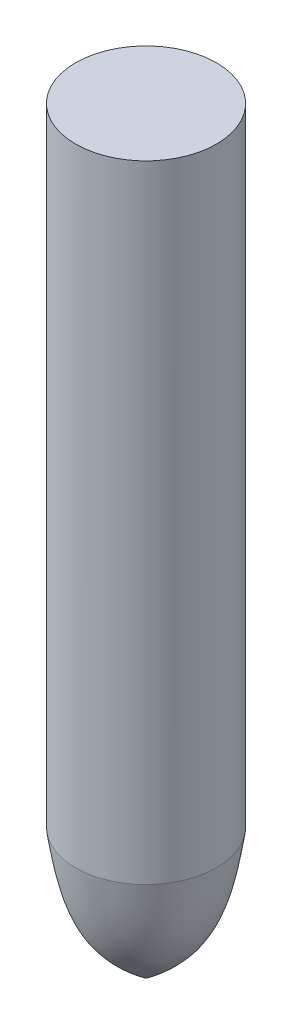
ISO-10303-21;
HEADER;
FILE_DESCRIPTION(('STEP AP214'),'2;1');
FILE_NAME('part.step','',(''),(''),'','','');
FILE_SCHEMA(('AUTOMOTIVE_DESIGN { 1 0 10303 214 1 1 1 1 }'));
ENDSEC;
DATA;
#1=APPLICATION_CONTEXT('core data for automotive mechanical design processes');
#2=APPLICATION_PROTOCOL_DEFINITION('international standard','automotive_design',2000,#1);
#3=PRODUCT_CONTEXT('',#1,'mechanical');
#4=PRODUCT('Part','Part','',(#3));
#5=PRODUCT_RELATED_PRODUCT_CATEGORY('part','',(#4));
#6=PRODUCT_DEFINITION_FORMATION('','',#4);
#7=PRODUCT_DEFINITION_CONTEXT('part definition',#1,'design');
#8=PRODUCT_DEFINITION('design','',#6,#7);
#9=PRODUCT_DEFINITION_SHAPE('','',#8);
#10=(LENGTH_UNIT() NAMED_UNIT(*) SI_UNIT(.MILLI.,.METRE.));
#11=(NAMED_UNIT(*) PLANE_ANGLE_UNIT() SI_UNIT($,.RADIAN.));
#12=(NAMED_UNIT(*) SI_UNIT($,.STERADIAN.) SOLID_ANGLE_UNIT());
#13=UNCERTAINTY_MEASURE_WITH_UNIT(LENGTH_MEASURE(1.E-05),#10,'distance_accuracy_value','');
#14=(GEOMETRIC_REPRESENTATION_CONTEXT(3) GLOBAL_UNCERTAINTY_ASSIGNED_CONTEXT((#13)) GLOBAL_UNIT_ASSIGNED_CONTEXT((#10,
#11,#12)) REPRESENTATION_CONTEXT('',''));
#15=CARTESIAN_POINT('',(0.,0.,0.));
#16=DIRECTION('',(0.,0.,1.));
#17=DIRECTION('',(1.,0.,0.));
#18=AXIS2_PLACEMENT_3D('',#15,#16,#17);
#19=CARTESIAN_POINT('',(0.,375.,0.));
#20=DIRECTION('',(0.,-1.,0.));
#21=DIRECTION('',(0.,0.,-1.));
#22=AXIS2_PLACEMENT_3D('',#19,#20,#21);
#23=CYLINDRICAL_SURFACE('',#22,70.);
#24=CARTESIAN_POINT('',(0.,375.,0.));
#25=DIRECTION('',(0.,1.,0.));
#26=DIRECTION('',(0.,0.,1.));
#27=AXIS2_PLACEMENT_3D('',#24,#25,#26);
#28=CIRCLE('',#27,70.);
#29=CARTESIAN_POINT('',(0.,375.,70.));
#30=VERTEX_POINT('',#29);
#31=EDGE_CURVE('E10',#30,#30,#28,.T.);
#32=ORIENTED_EDGE('',*,*,#31,.F.);
#33=EDGE_LOOP('',(#32));
#34=FACE_BOUND('',#33,.T.);
#35=CARTESIAN_POINT('',(0.,-247.794305725926,0.));
#36=DIRECTION('',(0.,-1.,0.));
#37=DIRECTION('',(0.,0.,-1.));
#38=AXIS2_PLACEMENT_3D('',#35,#36,#37);
#39=CIRCLE('',#38,70.);
#40=CARTESIAN_POINT('',(0.,-247.794305725926,-70.));
#41=VERTEX_POINT('',#40);
#42=EDGE_CURVE('E38',#41,#41,#39,.T.);
#43=ORIENTED_EDGE('',*,*,#42,.F.);
#44=EDGE_LOOP('',(#43));
#45=FACE_BOUND('',#44,.T.);
#46=ADVANCED_FACE('F28',(#34,#45),#23,.T.);
#47=CARTESIAN_POINT('',(0.,375.,0.));
#48=DIRECTION('',(0.,1.,0.));
#49=DIRECTION('',(0.,0.,1.));
#50=AXIS2_PLACEMENT_3D('',#47,#48,#49);
#51=PLANE('',#50);
#52=ORIENTED_EDGE('',*,*,#31,.T.);
#53=EDGE_LOOP('',(#52));
#54=FACE_BOUND('',#53,.T.);
#55=ADVANCED_FACE('F53',(#54),#51,.T.);
#56=CARTESIAN_POINT('',(0.,-377.97119896181,0.));
#57=CARTESIAN_POINT('',(-15.769115631653,-365.472402654188,0.));
#58=CARTESIAN_POINT('',(-56.7536963330036,-332.987516506786,0.));
#59=CARTESIAN_POINT('',(-64.9545094187256,-280.244229371744,0.));
#60=CARTESIAN_POINT('',(-70.,-247.794305725926,0.));
#61=B_SPLINE_CURVE_WITH_KNOTS('',3,(#56,#57,#58,#59,#60),.UNSPECIFIED.,.F.,.F.,(4,1,4),(0.,
0.384757276073179,1.),.UNSPECIFIED.);
#62=CARTESIAN_POINT('',(0.,-315.550160193087,0.));
#63=DIRECTION('',(0.,-1.,0.));
#64=AXIS1_PLACEMENT('',#62,#63);
#65=SURFACE_OF_REVOLUTION('',#61,#64);
#66=ORIENTED_EDGE('',*,*,#42,.T.);
#67=EDGE_LOOP('',(#66));
#68=FACE_BOUND('',#67,.T.);
#69=CARTESIAN_POINT('',(0.,-375.,0.));
#70=DIRECTION('',(0.,-1.,0.));
#71=DIRECTION('',(0.,0.,-1.));
#72=AXIS2_PLACEMENT_3D('',#69,#70,#71);
#73=CIRCLE('',#72,3.74432461317094);
#74=CARTESIAN_POINT('',(0.,-375.,-3.74432461317094));
#75=VERTEX_POINT('',#74);
#76=EDGE_CURVE('E31',#75,#75,#73,.F.);
#77=ORIENTED_EDGE('',*,*,#76,.T.);
#78=EDGE_LOOP('',(#77));
#79=FACE_BOUND('',#78,.T.);
#80=ADVANCED_FACE('F49',(#68,#79),#65,.F.);
#81=CARTESIAN_POINT('',(0.,-375.,0.));
#82=DIRECTION('',(0.,1.,0.));
#83=DIRECTION('',(0.,0.,1.));
#84=AXIS2_PLACEMENT_3D('',#81,#82,#83);
#85=PLANE('',#84);
#86=ORIENTED_EDGE('',*,*,#76,.F.);
#87=EDGE_LOOP('',(#86));
#88=FACE_BOUND('',#87,.T.);
#89=ADVANCED_FACE('F52',(#88),#85,.F.);
#90=CLOSED_SHELL('',(#46,#55,#80,#89));
#91=MANIFOLD_SOLID_BREP('B2',#90);
#92=ADVANCED_BREP_SHAPE_REPRESENTATION('',(#18,#91),#14);
#93=SHAPE_DEFINITION_REPRESENTATION(#9,#92);
ENDSEC;
END-ISO-10303-21;
